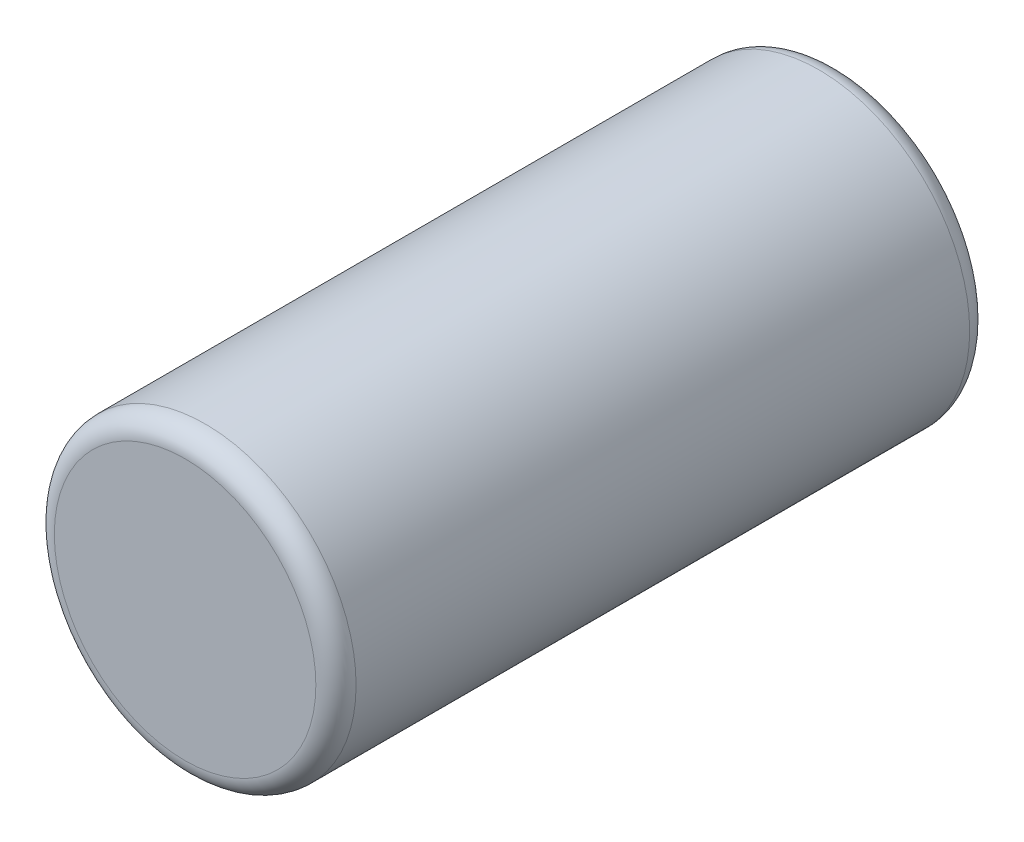
ISO-10303-21;
HEADER;
FILE_DESCRIPTION(('STEP AP214'),'2;1');
FILE_NAME('part.step','',(''),(''),'','','');
FILE_SCHEMA(('AUTOMOTIVE_DESIGN { 1 0 10303 214 1 1 1 1 }'));
ENDSEC;
DATA;
#1=APPLICATION_CONTEXT('core data for automotive mechanical design processes');
#2=APPLICATION_PROTOCOL_DEFINITION('international standard','automotive_design',2000,#1);
#3=PRODUCT_CONTEXT('',#1,'mechanical');
#4=PRODUCT('Part','Part','',(#3));
#5=PRODUCT_RELATED_PRODUCT_CATEGORY('part','',(#4));
#6=PRODUCT_DEFINITION_FORMATION('','',#4);
#7=PRODUCT_DEFINITION_CONTEXT('part definition',#1,'design');
#8=PRODUCT_DEFINITION('design','',#6,#7);
#9=PRODUCT_DEFINITION_SHAPE('','',#8);
#10=(LENGTH_UNIT() NAMED_UNIT(*) SI_UNIT(.MILLI.,.METRE.));
#11=(NAMED_UNIT(*) PLANE_ANGLE_UNIT() SI_UNIT($,.RADIAN.));
#12=(NAMED_UNIT(*) SI_UNIT($,.STERADIAN.) SOLID_ANGLE_UNIT());
#13=UNCERTAINTY_MEASURE_WITH_UNIT(LENGTH_MEASURE(1.E-05),#10,'distance_accuracy_value','');
#14=(GEOMETRIC_REPRESENTATION_CONTEXT(3) GLOBAL_UNCERTAINTY_ASSIGNED_CONTEXT((#13)) GLOBAL_UNIT_ASSIGNED_CONTEXT((#10,
#11,#12)) REPRESENTATION_CONTEXT('',''));
#15=CARTESIAN_POINT('',(0.,0.,0.));
#16=DIRECTION('',(0.,0.,1.));
#17=DIRECTION('',(1.,0.,0.));
#18=AXIS2_PLACEMENT_3D('',#15,#16,#17);
#19=CARTESIAN_POINT('',(0.,0.,6.5));
#20=DIRECTION('',(0.,0.,-1.));
#21=DIRECTION('',(-1.,0.,0.));
#22=AXIS2_PLACEMENT_3D('',#19,#20,#21);
#23=CYLINDRICAL_SURFACE('',#22,1.5);
#24=CARTESIAN_POINT('',(0.,0.,0.2));
#25=DIRECTION('',(0.,0.,1.));
#26=DIRECTION('',(1.,0.,0.));
#27=AXIS2_PLACEMENT_3D('',#24,#25,#26);
#28=CIRCLE('',#27,1.5);
#29=CARTESIAN_POINT('',(1.5,0.,0.2));
#30=VERTEX_POINT('',#29);
#31=EDGE_CURVE('E45',#30,#30,#28,.T.);
#32=ORIENTED_EDGE('',*,*,#31,.T.);
#33=EDGE_LOOP('',(#32));
#34=FACE_BOUND('',#33,.T.);
#35=CARTESIAN_POINT('',(0.,0.,6.3));
#36=DIRECTION('',(0.,0.,1.));
#37=DIRECTION('',(1.,0.,0.));
#38=AXIS2_PLACEMENT_3D('',#35,#36,#37);
#39=CIRCLE('',#38,1.5);
#40=CARTESIAN_POINT('',(1.5,0.,6.3));
#41=VERTEX_POINT('',#40);
#42=EDGE_CURVE('E49',#41,#41,#39,.F.);
#43=ORIENTED_EDGE('',*,*,#42,.T.);
#44=EDGE_LOOP('',(#43));
#45=FACE_BOUND('',#44,.T.);
#46=ADVANCED_FACE('F34',(#34,#45),#23,.T.);
#47=CARTESIAN_POINT('',(0.,0.,6.5));
#48=DIRECTION('',(0.,0.,1.));
#49=DIRECTION('',(1.,0.,0.));
#50=AXIS2_PLACEMENT_3D('',#47,#48,#49);
#51=PLANE('',#50);
#52=CARTESIAN_POINT('',(0.,0.,6.5));
#53=DIRECTION('',(0.,0.,1.));
#54=DIRECTION('',(1.,0.,0.));
#55=AXIS2_PLACEMENT_3D('',#52,#53,#54);
#56=CIRCLE('',#55,1.3);
#57=CARTESIAN_POINT('',(1.3,0.,6.5));
#58=VERTEX_POINT('',#57);
#59=EDGE_CURVE('E10',#58,#58,#56,.T.);
#60=ORIENTED_EDGE('',*,*,#59,.T.);
#61=EDGE_LOOP('',(#60));
#62=FACE_BOUND('',#61,.T.);
#63=ADVANCED_FACE('F65',(#62),#51,.T.);
#64=CARTESIAN_POINT('',(0.,0.,0.));
#65=DIRECTION('',(0.,0.,1.));
#66=DIRECTION('',(1.,0.,0.));
#67=AXIS2_PLACEMENT_3D('',#64,#65,#66);
#68=PLANE('',#67);
#69=CARTESIAN_POINT('',(0.,0.,0.));
#70=DIRECTION('',(0.,0.,1.));
#71=DIRECTION('',(1.,0.,0.));
#72=AXIS2_PLACEMENT_3D('',#69,#70,#71);
#73=CIRCLE('',#72,1.3);
#74=CARTESIAN_POINT('',(1.3,0.,0.));
#75=VERTEX_POINT('',#74);
#76=EDGE_CURVE('E41',#75,#75,#73,.F.);
#77=ORIENTED_EDGE('',*,*,#76,.T.);
#78=EDGE_LOOP('',(#77));
#79=FACE_BOUND('',#78,.T.);
#80=ADVANCED_FACE('F62',(#79),#68,.F.);
#81=CARTESIAN_POINT('',(0.,0.,0.2));
#82=DIRECTION('',(0.,0.,1.));
#83=DIRECTION('',(1.,0.,0.));
#84=AXIS2_PLACEMENT_3D('',#81,#82,#83);
#85=TOROIDAL_SURFACE('',#84,1.3,0.2);
#86=ORIENTED_EDGE('',*,*,#76,.F.);
#87=EDGE_LOOP('',(#86));
#88=FACE_BOUND('',#87,.T.);
#89=ORIENTED_EDGE('',*,*,#31,.F.);
#90=EDGE_LOOP('',(#89));
#91=FACE_BOUND('',#90,.T.);
#92=ADVANCED_FACE('F58',(#88,#91),#85,.T.);
#93=CARTESIAN_POINT('',(0.,0.,6.3));
#94=DIRECTION('',(0.,0.,1.));
#95=DIRECTION('',(1.,0.,0.));
#96=AXIS2_PLACEMENT_3D('',#93,#94,#95);
#97=TOROIDAL_SURFACE('',#96,1.3,0.2);
#98=ORIENTED_EDGE('',*,*,#42,.F.);
#99=EDGE_LOOP('',(#98));
#100=FACE_BOUND('',#99,.T.);
#101=ORIENTED_EDGE('',*,*,#59,.F.);
#102=EDGE_LOOP('',(#101));
#103=FACE_BOUND('',#102,.T.);
#104=ADVANCED_FACE('F36',(#100,#103),#97,.T.);
#105=CLOSED_SHELL('',(#46,#63,#80,#92,#104));
#106=MANIFOLD_SOLID_BREP('B2',#105);
#107=ADVANCED_BREP_SHAPE_REPRESENTATION('',(#18,#106),#14);
#108=SHAPE_DEFINITION_REPRESENTATION(#9,#107);
ENDSEC;
END-ISO-10303-21;
